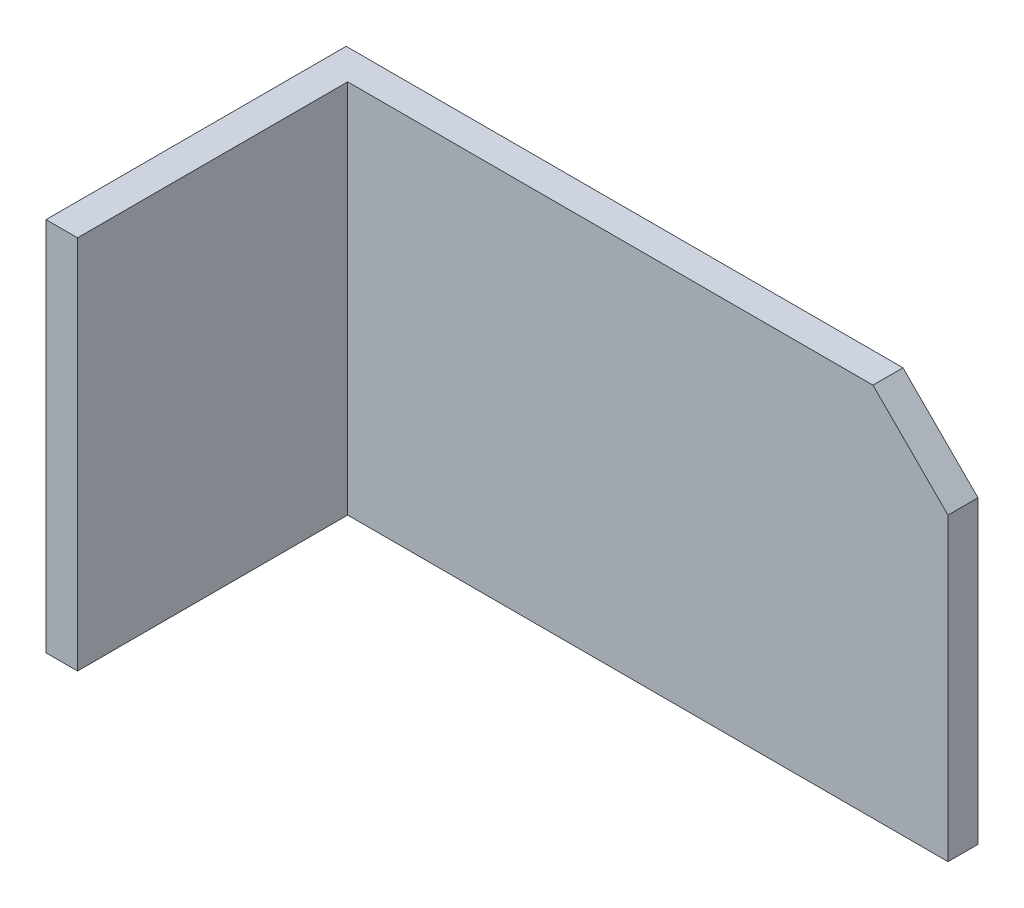
ISO-10303-21;
HEADER;
FILE_DESCRIPTION(('STEP AP214'),'2;1');
FILE_NAME('part.step','',(''),(''),'','','');
FILE_SCHEMA(('AUTOMOTIVE_DESIGN { 1 0 10303 214 1 1 1 1 }'));
ENDSEC;
DATA;
#1=APPLICATION_CONTEXT('core data for automotive mechanical design processes');
#2=APPLICATION_PROTOCOL_DEFINITION('international standard','automotive_design',2000,#1);
#3=PRODUCT_CONTEXT('',#1,'mechanical');
#4=PRODUCT('Part','Part','',(#3));
#5=PRODUCT_RELATED_PRODUCT_CATEGORY('part','',(#4));
#6=PRODUCT_DEFINITION_FORMATION('','',#4);
#7=PRODUCT_DEFINITION_CONTEXT('part definition',#1,'design');
#8=PRODUCT_DEFINITION('design','',#6,#7);
#9=PRODUCT_DEFINITION_SHAPE('','',#8);
#10=(LENGTH_UNIT() NAMED_UNIT(*) SI_UNIT(.MILLI.,.METRE.));
#11=(NAMED_UNIT(*) PLANE_ANGLE_UNIT() SI_UNIT($,.RADIAN.));
#12=(NAMED_UNIT(*) SI_UNIT($,.STERADIAN.) SOLID_ANGLE_UNIT());
#13=UNCERTAINTY_MEASURE_WITH_UNIT(LENGTH_MEASURE(1.E-05),#10,'distance_accuracy_value','');
#14=(GEOMETRIC_REPRESENTATION_CONTEXT(3) GLOBAL_UNCERTAINTY_ASSIGNED_CONTEXT((#13)) GLOBAL_UNIT_ASSIGNED_CONTEXT((#10,
#11,#12)) REPRESENTATION_CONTEXT('',''));
#15=CARTESIAN_POINT('',(0.,0.,0.));
#16=DIRECTION('',(0.,0.,1.));
#17=DIRECTION('',(1.,0.,0.));
#18=AXIS2_PLACEMENT_3D('',#15,#16,#17);
#19=CARTESIAN_POINT('',(-1.53882069959544,0.75,0.2));
#20=DIRECTION('',(0.,0.,1.));
#21=DIRECTION('',(1.,0.,0.));
#22=AXIS2_PLACEMENT_3D('',#19,#20,#21);
#23=PLANE('',#22);
#24=DIRECTION('',(1.,0.,0.));
#25=VECTOR('',#24,1.);
#26=CARTESIAN_POINT('',(-1.41898707437652,0.875,0.2));
#27=LINE('',#26,#25);
#28=CARTESIAN_POINT('',(-1.54932069959544,0.875,0.2));
#29=VERTEX_POINT('',#28);
#30=CARTESIAN_POINT('',(-1.52832069959544,0.875,0.2));
#31=VERTEX_POINT('',#30);
#32=EDGE_CURVE('E154',#29,#31,#27,.T.);
#33=ORIENTED_EDGE('',*,*,#32,.F.);
#34=DIRECTION('',(0.,-1.,0.));
#35=VECTOR('',#34,1.);
#36=CARTESIAN_POINT('',(-1.54932069959544,0.75,0.2));
#37=LINE('',#36,#35);
#38=CARTESIAN_POINT('',(-1.54932069959544,0.625,0.2));
#39=VERTEX_POINT('',#38);
#40=EDGE_CURVE('E135',#29,#39,#37,.T.);
#41=ORIENTED_EDGE('',*,*,#40,.T.);
#42=DIRECTION('',(1.,0.,0.));
#43=VECTOR('',#42,1.);
#44=CARTESIAN_POINT('',(-1.39679171408819,0.625,0.2));
#45=LINE('',#44,#43);
#46=CARTESIAN_POINT('',(-1.52832069959544,0.625,0.2));
#47=VERTEX_POINT('',#46);
#48=EDGE_CURVE('E143',#39,#47,#45,.T.);
#49=ORIENTED_EDGE('',*,*,#48,.T.);
#50=DIRECTION('',(0.,-1.,0.));
#51=VECTOR('',#50,1.);
#52=CARTESIAN_POINT('',(-1.52832069959544,0.75,0.2));
#53=LINE('',#52,#51);
#54=EDGE_CURVE('E11',#31,#47,#53,.T.);
#55=ORIENTED_EDGE('',*,*,#54,.F.);
#56=EDGE_LOOP('',(#33,#41,#49,#55));
#57=FACE_BOUND('',#56,.T.);
#58=ADVANCED_FACE('F17',(#57),#23,.T.);
#59=CARTESIAN_POINT('',(-1.52832069959544,0.75,0.11));
#60=DIRECTION('',(1.,0.,0.));
#61=DIRECTION('',(0.,0.,1.));
#62=AXIS2_PLACEMENT_3D('',#59,#60,#61);
#63=PLANE('',#62);
#64=DIRECTION('',(0.,0.,-1.));
#65=VECTOR('',#64,1.);
#66=CARTESIAN_POINT('',(-1.52832069959544,0.875,0.0448336252189144));
#67=LINE('',#66,#65);
#68=CARTESIAN_POINT('',(-1.52832069959544,0.875,0.02));
#69=VERTEX_POINT('',#68);
#70=EDGE_CURVE('E168',#31,#69,#67,.T.);
#71=ORIENTED_EDGE('',*,*,#70,.F.);
#72=ORIENTED_EDGE('',*,*,#54,.T.);
#73=DIRECTION('',(0.,0.,-1.));
#74=VECTOR('',#73,1.);
#75=CARTESIAN_POINT('',(-1.52832069959544,0.625,0.0420289855072467));
#76=LINE('',#75,#74);
#77=CARTESIAN_POINT('',(-1.52832069959544,0.625,0.02));
#78=VERTEX_POINT('',#77);
#79=EDGE_CURVE('E133',#47,#78,#76,.T.);
#80=ORIENTED_EDGE('',*,*,#79,.T.);
#81=DIRECTION('',(0.,-1.,0.));
#82=VECTOR('',#81,1.);
#83=CARTESIAN_POINT('',(-1.52832069959544,0.746711342510851,0.02));
#84=LINE('',#83,#82);
#85=EDGE_CURVE('E27',#69,#78,#84,.T.);
#86=ORIENTED_EDGE('',*,*,#85,.F.);
#87=EDGE_LOOP('',(#71,#72,#80,#86));
#88=FACE_BOUND('',#87,.T.);
#89=ADVANCED_FACE('F19',(#88),#63,.T.);
#90=CARTESIAN_POINT('',(-1.33333807407652,0.746711342510851,0.02));
#91=DIRECTION('',(0.,0.,1.));
#92=DIRECTION('',(1.,0.,0.));
#93=AXIS2_PLACEMENT_3D('',#90,#91,#92);
#94=PLANE('',#93);
#95=DIRECTION('',(0.707106781186546,-0.707106781186549,0.));
#96=VECTOR('',#95,1.);
#97=CARTESIAN_POINT('',(-1.15332069959544,0.85,0.02));
#98=LINE('',#97,#96);
#99=CARTESIAN_POINT('',(-1.17832069959543,0.875,0.02));
#100=VERTEX_POINT('',#99);
#101=CARTESIAN_POINT('',(-1.12832069959544,0.825,0.02));
#102=VERTEX_POINT('',#101);
#103=EDGE_CURVE('E103',#100,#102,#98,.T.);
#104=ORIENTED_EDGE('',*,*,#103,.F.);
#105=DIRECTION('',(1.,0.,0.));
#106=VECTOR('',#105,1.);
#107=CARTESIAN_POINT('',(-1.41898707437652,0.875,0.02));
#108=LINE('',#107,#106);
#109=EDGE_CURVE('E172',#69,#100,#108,.T.);
#110=ORIENTED_EDGE('',*,*,#109,.F.);
#111=ORIENTED_EDGE('',*,*,#85,.T.);
#112=DIRECTION('',(1.,0.,0.));
#113=VECTOR('',#112,1.);
#114=CARTESIAN_POINT('',(-1.39679171408819,0.625,0.02));
#115=LINE('',#114,#113);
#116=CARTESIAN_POINT('',(-1.12832069959544,0.625,0.02));
#117=VERTEX_POINT('',#116);
#118=EDGE_CURVE('E131',#78,#117,#115,.T.);
#119=ORIENTED_EDGE('',*,*,#118,.T.);
#120=DIRECTION('',(0.,-1.,0.));
#121=VECTOR('',#120,1.);
#122=CARTESIAN_POINT('',(-1.12832069959544,0.725,0.02));
#123=LINE('',#122,#121);
#124=EDGE_CURVE('E99',#102,#117,#123,.T.);
#125=ORIENTED_EDGE('',*,*,#124,.F.);
#126=EDGE_LOOP('',(#104,#110,#111,#119,#125));
#127=FACE_BOUND('',#126,.T.);
#128=ADVANCED_FACE('F179',(#127),#94,.T.);
#129=CARTESIAN_POINT('',(-1.41898707437652,0.875,0.0448336252189144));
#130=DIRECTION('',(0.,1.,0.));
#131=DIRECTION('',(1.,0.,0.));
#132=AXIS2_PLACEMENT_3D('',#129,#130,#131);
#133=PLANE('',#132);
#134=DIRECTION('',(0.,0.,1.));
#135=VECTOR('',#134,1.);
#136=CARTESIAN_POINT('',(-1.54932069959544,0.875,0.1));
#137=LINE('',#136,#135);
#138=CARTESIAN_POINT('',(-1.54932069959544,0.875,0.));
#139=VERTEX_POINT('',#138);
#140=EDGE_CURVE('E138',#139,#29,#137,.T.);
#141=ORIENTED_EDGE('',*,*,#140,.T.);
#142=ORIENTED_EDGE('',*,*,#32,.T.);
#143=ORIENTED_EDGE('',*,*,#70,.T.);
#144=ORIENTED_EDGE('',*,*,#109,.T.);
#145=DIRECTION('',(0.,0.,1.));
#146=VECTOR('',#145,1.);
#147=CARTESIAN_POINT('',(-1.17832069959543,0.875,0.01));
#148=LINE('',#147,#146);
#149=CARTESIAN_POINT('',(-1.17832069959543,0.875,0.));
#150=VERTEX_POINT('',#149);
#151=EDGE_CURVE('E147',#150,#100,#148,.T.);
#152=ORIENTED_EDGE('',*,*,#151,.F.);
#153=DIRECTION('',(-1.,0.,0.));
#154=VECTOR('',#153,1.);
#155=CARTESIAN_POINT('',(-1.34391182083059,0.875,0.));
#156=LINE('',#155,#154);
#157=EDGE_CURVE('E129',#150,#139,#156,.T.);
#158=ORIENTED_EDGE('',*,*,#157,.T.);
#159=EDGE_LOOP('',(#141,#142,#143,#144,#152,#158));
#160=FACE_BOUND('',#159,.T.);
#161=ADVANCED_FACE('F195',(#160),#133,.T.);
#162=CARTESIAN_POINT('',(-1.54932069959544,0.75,0.1));
#163=DIRECTION('',(1.,0.,0.));
#164=DIRECTION('',(0.,-1.,0.));
#165=AXIS2_PLACEMENT_3D('',#162,#163,#164);
#166=PLANE('',#165);
#167=DIRECTION('',(0.,-1.,0.));
#168=VECTOR('',#167,1.);
#169=CARTESIAN_POINT('',(-1.54932069959544,0.746816562660916,0.));
#170=LINE('',#169,#168);
#171=CARTESIAN_POINT('',(-1.54932069959544,0.625,0.));
#172=VERTEX_POINT('',#171);
#173=EDGE_CURVE('E115',#139,#172,#170,.T.);
#174=ORIENTED_EDGE('',*,*,#173,.T.);
#175=DIRECTION('',(0.,0.,1.));
#176=VECTOR('',#175,1.);
#177=CARTESIAN_POINT('',(-1.54932069959544,0.625,0.0420289855072467));
#178=LINE('',#177,#176);
#179=EDGE_CURVE('E110',#172,#39,#178,.T.);
#180=ORIENTED_EDGE('',*,*,#179,.T.);
#181=ORIENTED_EDGE('',*,*,#40,.F.);
#182=ORIENTED_EDGE('',*,*,#140,.F.);
#183=EDGE_LOOP('',(#174,#180,#181,#182));
#184=FACE_BOUND('',#183,.T.);
#185=ADVANCED_FACE('F184',(#184),#166,.F.);
#186=CARTESIAN_POINT('',(-1.39679171408819,0.625,0.0420289855072467));
#187=DIRECTION('',(0.,1.,0.));
#188=DIRECTION('',(0.,0.,-1.));
#189=AXIS2_PLACEMENT_3D('',#186,#187,#188);
#190=PLANE('',#189);
#191=ORIENTED_EDGE('',*,*,#118,.F.);
#192=ORIENTED_EDGE('',*,*,#79,.F.);
#193=ORIENTED_EDGE('',*,*,#48,.F.);
#194=ORIENTED_EDGE('',*,*,#179,.F.);
#195=DIRECTION('',(1.,0.,0.));
#196=VECTOR('',#195,1.);
#197=CARTESIAN_POINT('',(-1.34391182083059,0.625,0.));
#198=LINE('',#197,#196);
#199=CARTESIAN_POINT('',(-1.12832069959544,0.625,0.));
#200=VERTEX_POINT('',#199);
#201=EDGE_CURVE('E106',#172,#200,#198,.T.);
#202=ORIENTED_EDGE('',*,*,#201,.T.);
#203=DIRECTION('',(0.,0.,-1.));
#204=VECTOR('',#203,1.);
#205=CARTESIAN_POINT('',(-1.12832069959544,0.625,0.01));
#206=LINE('',#205,#204);
#207=EDGE_CURVE('E93',#117,#200,#206,.T.);
#208=ORIENTED_EDGE('',*,*,#207,.F.);
#209=EDGE_LOOP('',(#191,#192,#193,#194,#202,#208));
#210=FACE_BOUND('',#209,.T.);
#211=ADVANCED_FACE('F107',(#210),#190,.F.);
#212=CARTESIAN_POINT('',(-1.12832069959544,0.725,0.01));
#213=DIRECTION('',(1.,0.,0.));
#214=DIRECTION('',(0.,0.,1.));
#215=AXIS2_PLACEMENT_3D('',#212,#213,#214);
#216=PLANE('',#215);
#217=ORIENTED_EDGE('',*,*,#207,.T.);
#218=DIRECTION('',(0.,1.,0.));
#219=VECTOR('',#218,1.);
#220=CARTESIAN_POINT('',(-1.12832069959544,0.746816562660916,0.));
#221=LINE('',#220,#219);
#222=CARTESIAN_POINT('',(-1.12832069959544,0.825,0.));
#223=VERTEX_POINT('',#222);
#224=EDGE_CURVE('E98',#200,#223,#221,.T.);
#225=ORIENTED_EDGE('',*,*,#224,.T.);
#226=DIRECTION('',(0.,0.,-1.));
#227=VECTOR('',#226,1.);
#228=CARTESIAN_POINT('',(-1.12832069959544,0.825,0.01));
#229=LINE('',#228,#227);
#230=EDGE_CURVE('E144',#102,#223,#229,.T.);
#231=ORIENTED_EDGE('',*,*,#230,.F.);
#232=ORIENTED_EDGE('',*,*,#124,.T.);
#233=EDGE_LOOP('',(#217,#225,#231,#232));
#234=FACE_BOUND('',#233,.T.);
#235=ADVANCED_FACE('F95',(#234),#216,.T.);
#236=CARTESIAN_POINT('',(-1.15332069959544,0.85,0.01));
#237=DIRECTION('',(0.707106781186549,0.707106781186546,0.));
#238=DIRECTION('',(0.,0.,-1.));
#239=AXIS2_PLACEMENT_3D('',#236,#237,#238);
#240=PLANE('',#239);
#241=ORIENTED_EDGE('',*,*,#230,.T.);
#242=DIRECTION('',(-0.707106781186543,0.707106781186552,0.));
#243=VECTOR('',#242,1.);
#244=CARTESIAN_POINT('',(-1.12832069959544,0.825,0.));
#245=LINE('',#244,#243);
#246=EDGE_CURVE('E121',#223,#150,#245,.T.);
#247=ORIENTED_EDGE('',*,*,#246,.T.);
#248=ORIENTED_EDGE('',*,*,#151,.T.);
#249=ORIENTED_EDGE('',*,*,#103,.T.);
#250=EDGE_LOOP('',(#241,#247,#248,#249));
#251=FACE_BOUND('',#250,.T.);
#252=ADVANCED_FACE('F194',(#251),#240,.T.);
#253=CARTESIAN_POINT('',(-1.34391182083059,0.746816562660916,0.));
#254=DIRECTION('',(0.,0.,1.));
#255=DIRECTION('',(1.,0.,0.));
#256=AXIS2_PLACEMENT_3D('',#253,#254,#255);
#257=PLANE('',#256);
#258=ORIENTED_EDGE('',*,*,#224,.F.);
#259=ORIENTED_EDGE('',*,*,#201,.F.);
#260=ORIENTED_EDGE('',*,*,#173,.F.);
#261=ORIENTED_EDGE('',*,*,#157,.F.);
#262=ORIENTED_EDGE('',*,*,#246,.F.);
#263=EDGE_LOOP('',(#258,#259,#260,#261,#262));
#264=FACE_BOUND('',#263,.T.);
#265=ADVANCED_FACE('F118',(#264),#257,.F.);
#266=CLOSED_SHELL('',(#58,#89,#128,#161,#185,#211,#235,#252,#265));
#267=MANIFOLD_SOLID_BREP('B1',#266);
#268=ADVANCED_BREP_SHAPE_REPRESENTATION('',(#18,#267),#14);
#269=SHAPE_DEFINITION_REPRESENTATION(#9,#268);
ENDSEC;
END-ISO-10303-21;
